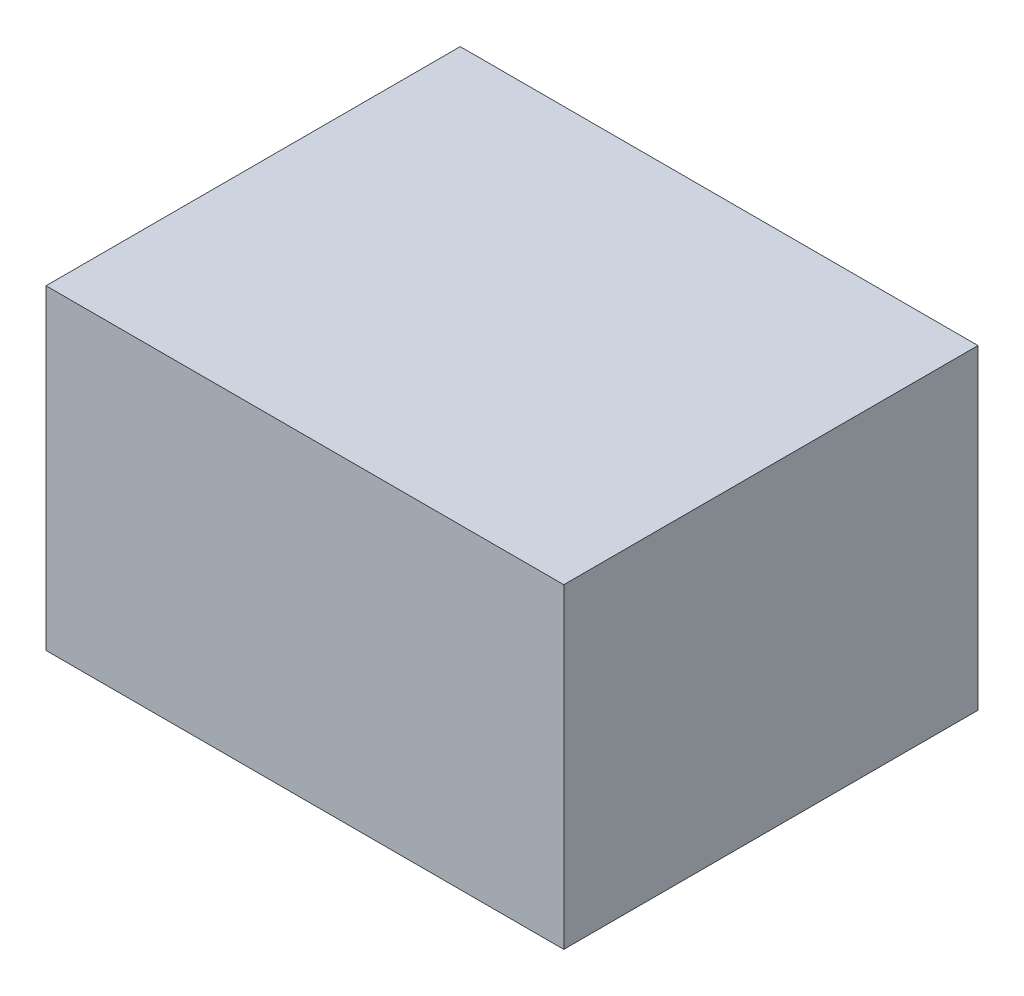
ISO-10303-21;
HEADER;
FILE_DESCRIPTION(('STEP AP214'),'2;1');
FILE_NAME('part.step','',(''),(''),'','','');
FILE_SCHEMA(('AUTOMOTIVE_DESIGN { 1 0 10303 214 1 1 1 1 }'));
ENDSEC;
DATA;
#1=APPLICATION_CONTEXT('core data for automotive mechanical design processes');
#2=APPLICATION_PROTOCOL_DEFINITION('international standard','automotive_design',2000,#1);
#3=PRODUCT_CONTEXT('',#1,'mechanical');
#4=PRODUCT('Part','Part','',(#3));
#5=PRODUCT_RELATED_PRODUCT_CATEGORY('part','',(#4));
#6=PRODUCT_DEFINITION_FORMATION('','',#4);
#7=PRODUCT_DEFINITION_CONTEXT('part definition',#1,'design');
#8=PRODUCT_DEFINITION('design','',#6,#7);
#9=PRODUCT_DEFINITION_SHAPE('','',#8);
#10=(LENGTH_UNIT() NAMED_UNIT(*) SI_UNIT(.MILLI.,.METRE.));
#11=(NAMED_UNIT(*) PLANE_ANGLE_UNIT() SI_UNIT($,.RADIAN.));
#12=(NAMED_UNIT(*) SI_UNIT($,.STERADIAN.) SOLID_ANGLE_UNIT());
#13=UNCERTAINTY_MEASURE_WITH_UNIT(LENGTH_MEASURE(1.E-05),#10,'distance_accuracy_value','');
#14=(GEOMETRIC_REPRESENTATION_CONTEXT(3) GLOBAL_UNCERTAINTY_ASSIGNED_CONTEXT((#13)) GLOBAL_UNIT_ASSIGNED_CONTEXT((#10,
#11,#12)) REPRESENTATION_CONTEXT('',''));
#15=CARTESIAN_POINT('',(0.,0.,0.));
#16=DIRECTION('',(0.,0.,1.));
#17=DIRECTION('',(1.,0.,0.));
#18=AXIS2_PLACEMENT_3D('',#15,#16,#17);
#19=CARTESIAN_POINT('',(-2.5,3.05,-2.));
#20=DIRECTION('',(1.,0.,0.));
#21=DIRECTION('',(0.,0.,-1.));
#22=AXIS2_PLACEMENT_3D('',#19,#20,#21);
#23=PLANE('',#22);
#24=DIRECTION('',(0.,0.,1.));
#25=VECTOR('',#24,1.);
#26=CARTESIAN_POINT('',(-2.5,0.,-2.));
#27=LINE('',#26,#25);
#28=CARTESIAN_POINT('',(-2.5,0.,-2.));
#29=VERTEX_POINT('',#28);
#30=CARTESIAN_POINT('',(-2.5,0.,2.));
#31=VERTEX_POINT('',#30);
#32=EDGE_CURVE('E98',#29,#31,#27,.T.);
#33=ORIENTED_EDGE('',*,*,#32,.T.);
#34=DIRECTION('',(0.,-1.,0.));
#35=VECTOR('',#34,1.);
#36=CARTESIAN_POINT('',(-2.5,3.05,2.));
#37=LINE('',#36,#35);
#38=CARTESIAN_POINT('',(-2.5,3.05,2.));
#39=VERTEX_POINT('',#38);
#40=EDGE_CURVE('E11',#39,#31,#37,.T.);
#41=ORIENTED_EDGE('',*,*,#40,.F.);
#42=DIRECTION('',(0.,0.,1.));
#43=VECTOR('',#42,1.);
#44=CARTESIAN_POINT('',(-2.5,3.05,-2.));
#45=LINE('',#44,#43);
#46=CARTESIAN_POINT('',(-2.5,3.05,-2.));
#47=VERTEX_POINT('',#46);
#48=EDGE_CURVE('E86',#47,#39,#45,.T.);
#49=ORIENTED_EDGE('',*,*,#48,.F.);
#50=DIRECTION('',(0.,-1.,0.));
#51=VECTOR('',#50,1.);
#52=CARTESIAN_POINT('',(-2.5,3.05,-2.));
#53=LINE('',#52,#51);
#54=EDGE_CURVE('E94',#47,#29,#53,.T.);
#55=ORIENTED_EDGE('',*,*,#54,.T.);
#56=EDGE_LOOP('',(#33,#41,#49,#55));
#57=FACE_BOUND('',#56,.T.);
#58=ADVANCED_FACE('F35',(#57),#23,.F.);
#59=CARTESIAN_POINT('',(-2.5,3.05,2.));
#60=DIRECTION('',(0.,0.,-1.));
#61=DIRECTION('',(-1.,0.,0.));
#62=AXIS2_PLACEMENT_3D('',#59,#60,#61);
#63=PLANE('',#62);
#64=DIRECTION('',(1.,0.,0.));
#65=VECTOR('',#64,1.);
#66=CARTESIAN_POINT('',(-2.5,0.,2.));
#67=LINE('',#66,#65);
#68=CARTESIAN_POINT('',(2.5,0.,2.));
#69=VERTEX_POINT('',#68);
#70=EDGE_CURVE('E90',#31,#69,#67,.T.);
#71=ORIENTED_EDGE('',*,*,#70,.T.);
#72=DIRECTION('',(0.,-1.,0.));
#73=VECTOR('',#72,1.);
#74=CARTESIAN_POINT('',(2.5,3.05,2.));
#75=LINE('',#74,#73);
#76=CARTESIAN_POINT('',(2.5,3.05,2.));
#77=VERTEX_POINT('',#76);
#78=EDGE_CURVE('E43',#77,#69,#75,.T.);
#79=ORIENTED_EDGE('',*,*,#78,.F.);
#80=DIRECTION('',(1.,0.,0.));
#81=VECTOR('',#80,1.);
#82=CARTESIAN_POINT('',(-2.5,3.05,2.));
#83=LINE('',#82,#81);
#84=EDGE_CURVE('E81',#39,#77,#83,.T.);
#85=ORIENTED_EDGE('',*,*,#84,.F.);
#86=ORIENTED_EDGE('',*,*,#40,.T.);
#87=EDGE_LOOP('',(#71,#79,#85,#86));
#88=FACE_BOUND('',#87,.T.);
#89=ADVANCED_FACE('F89',(#88),#63,.F.);
#90=CARTESIAN_POINT('',(2.5,3.05,-2.));
#91=DIRECTION('',(-1.,0.,0.));
#92=DIRECTION('',(0.,0.,1.));
#93=AXIS2_PLACEMENT_3D('',#90,#91,#92);
#94=PLANE('',#93);
#95=DIRECTION('',(0.,0.,-1.));
#96=VECTOR('',#95,1.);
#97=CARTESIAN_POINT('',(2.5,0.,-2.));
#98=LINE('',#97,#96);
#99=CARTESIAN_POINT('',(2.5,0.,-2.));
#100=VERTEX_POINT('',#99);
#101=EDGE_CURVE('E68',#69,#100,#98,.T.);
#102=ORIENTED_EDGE('',*,*,#101,.T.);
#103=DIRECTION('',(0.,-1.,0.));
#104=VECTOR('',#103,1.);
#105=CARTESIAN_POINT('',(2.5,3.05,-2.));
#106=LINE('',#105,#104);
#107=CARTESIAN_POINT('',(2.5,3.05,-2.));
#108=VERTEX_POINT('',#107);
#109=EDGE_CURVE('E91',#108,#100,#106,.T.);
#110=ORIENTED_EDGE('',*,*,#109,.F.);
#111=DIRECTION('',(0.,0.,-1.));
#112=VECTOR('',#111,1.);
#113=CARTESIAN_POINT('',(2.5,3.05,-2.));
#114=LINE('',#113,#112);
#115=EDGE_CURVE('E84',#77,#108,#114,.T.);
#116=ORIENTED_EDGE('',*,*,#115,.F.);
#117=ORIENTED_EDGE('',*,*,#78,.T.);
#118=EDGE_LOOP('',(#102,#110,#116,#117));
#119=FACE_BOUND('',#118,.T.);
#120=ADVANCED_FACE('F92',(#119),#94,.F.);
#121=CARTESIAN_POINT('',(-2.5,3.05,-2.));
#122=DIRECTION('',(0.,0.,1.));
#123=DIRECTION('',(1.,0.,0.));
#124=AXIS2_PLACEMENT_3D('',#121,#122,#123);
#125=PLANE('',#124);
#126=DIRECTION('',(-1.,0.,0.));
#127=VECTOR('',#126,1.);
#128=CARTESIAN_POINT('',(-2.5,0.,-2.));
#129=LINE('',#128,#127);
#130=EDGE_CURVE('E74',#100,#29,#129,.T.);
#131=ORIENTED_EDGE('',*,*,#130,.T.);
#132=ORIENTED_EDGE('',*,*,#54,.F.);
#133=DIRECTION('',(-1.,0.,0.));
#134=VECTOR('',#133,1.);
#135=CARTESIAN_POINT('',(-2.5,3.05,-2.));
#136=LINE('',#135,#134);
#137=EDGE_CURVE('E51',#108,#47,#136,.T.);
#138=ORIENTED_EDGE('',*,*,#137,.F.);
#139=ORIENTED_EDGE('',*,*,#109,.T.);
#140=EDGE_LOOP('',(#131,#132,#138,#139));
#141=FACE_BOUND('',#140,.T.);
#142=ADVANCED_FACE('F105',(#141),#125,.F.);
#143=CARTESIAN_POINT('',(0.,3.05,0.));
#144=DIRECTION('',(0.,1.,0.));
#145=DIRECTION('',(0.,0.,1.));
#146=AXIS2_PLACEMENT_3D('',#143,#144,#145);
#147=PLANE('',#146);
#148=ORIENTED_EDGE('',*,*,#48,.T.);
#149=ORIENTED_EDGE('',*,*,#84,.T.);
#150=ORIENTED_EDGE('',*,*,#115,.T.);
#151=ORIENTED_EDGE('',*,*,#137,.T.);
#152=EDGE_LOOP('',(#148,#149,#150,#151));
#153=FACE_BOUND('',#152,.T.);
#154=ADVANCED_FACE('F82',(#153),#147,.T.);
#155=CARTESIAN_POINT('',(0.,0.,0.));
#156=DIRECTION('',(0.,1.,0.));
#157=DIRECTION('',(0.,0.,1.));
#158=AXIS2_PLACEMENT_3D('',#155,#156,#157);
#159=PLANE('',#158);
#160=ORIENTED_EDGE('',*,*,#32,.F.);
#161=ORIENTED_EDGE('',*,*,#130,.F.);
#162=ORIENTED_EDGE('',*,*,#101,.F.);
#163=ORIENTED_EDGE('',*,*,#70,.F.);
#164=EDGE_LOOP('',(#160,#161,#162,#163));
#165=FACE_BOUND('',#164,.T.);
#166=ADVANCED_FACE('F108',(#165),#159,.F.);
#167=CLOSED_SHELL('',(#58,#89,#120,#142,#154,#166));
#168=MANIFOLD_SOLID_BREP('B2',#167);
#169=ADVANCED_BREP_SHAPE_REPRESENTATION('',(#18,#168),#14);
#170=SHAPE_DEFINITION_REPRESENTATION(#9,#169);
ENDSEC;
END-ISO-10303-21;
